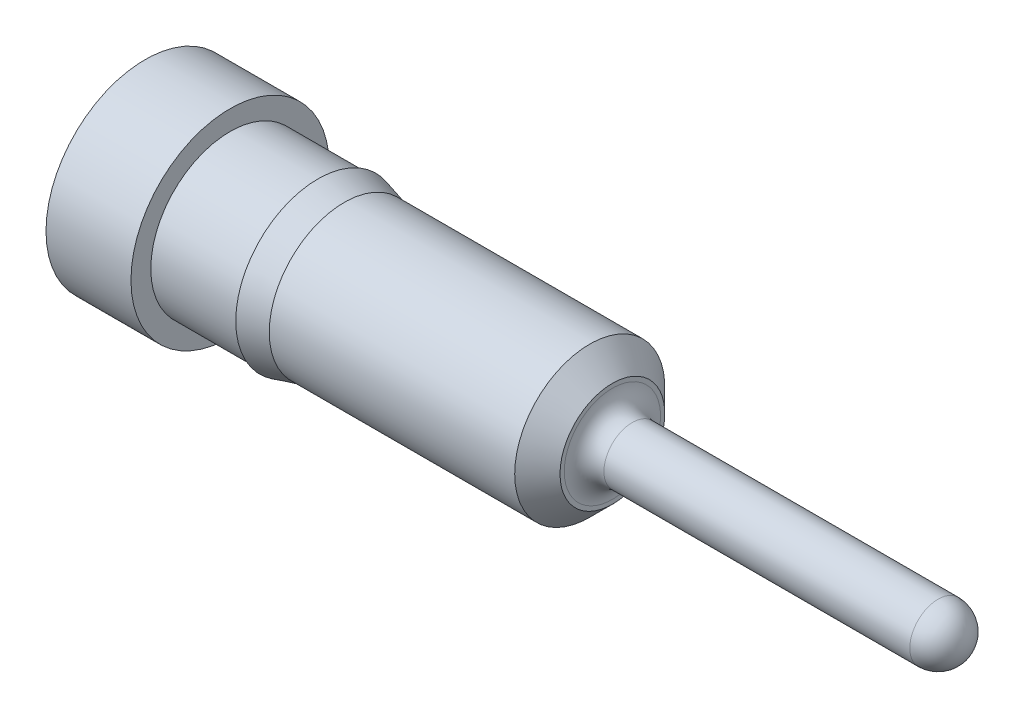
ISO-10303-21;
HEADER;
FILE_DESCRIPTION(('STEP AP214'),'2;1');
FILE_NAME('part.step','',(''),(''),'','','');
FILE_SCHEMA(('AUTOMOTIVE_DESIGN { 1 0 10303 214 1 1 1 1 }'));
ENDSEC;
DATA;
#1=APPLICATION_CONTEXT('core data for automotive mechanical design processes');
#2=APPLICATION_PROTOCOL_DEFINITION('international standard','automotive_design',2000,#1);
#3=PRODUCT_CONTEXT('',#1,'mechanical');
#4=PRODUCT('Part','Part','',(#3));
#5=PRODUCT_RELATED_PRODUCT_CATEGORY('part','',(#4));
#6=PRODUCT_DEFINITION_FORMATION('','',#4);
#7=PRODUCT_DEFINITION_CONTEXT('part definition',#1,'design');
#8=PRODUCT_DEFINITION('design','',#6,#7);
#9=PRODUCT_DEFINITION_SHAPE('','',#8);
#10=(LENGTH_UNIT() NAMED_UNIT(*) SI_UNIT(.MILLI.,.METRE.));
#11=(NAMED_UNIT(*) PLANE_ANGLE_UNIT() SI_UNIT($,.RADIAN.));
#12=(NAMED_UNIT(*) SI_UNIT($,.STERADIAN.) SOLID_ANGLE_UNIT());
#13=UNCERTAINTY_MEASURE_WITH_UNIT(LENGTH_MEASURE(1.E-05),#10,'distance_accuracy_value','');
#14=(GEOMETRIC_REPRESENTATION_CONTEXT(3) GLOBAL_UNCERTAINTY_ASSIGNED_CONTEXT((#13)) GLOBAL_UNIT_ASSIGNED_CONTEXT((#10,
#11,#12)) REPRESENTATION_CONTEXT('',''));
#15=CARTESIAN_POINT('',(0.,0.,0.));
#16=DIRECTION('',(0.,0.,1.));
#17=DIRECTION('',(1.,0.,0.));
#18=AXIS2_PLACEMENT_3D('',#15,#16,#17);
#19=CARTESIAN_POINT('',(4.19099999999997,0.,0.));
#20=DIRECTION('',(-1.,0.,0.));
#21=DIRECTION('',(0.,0.,1.));
#22=AXIS2_PLACEMENT_3D('',#19,#20,#21);
#23=CONICAL_SURFACE('',#22,0.469899999999995,0.785398163397517);
#24=CARTESIAN_POINT('',(3.98780000000001,0.,0.));
#25=DIRECTION('',(-1.,0.,0.));
#26=DIRECTION('',(0.,0.,1.));
#27=AXIS2_PLACEMENT_3D('',#24,#25,#26);
#28=CIRCLE('',#27,0.673099999999982);
#29=CARTESIAN_POINT('',(3.98780000000001,0.,0.673099999999982));
#30=VERTEX_POINT('',#29);
#31=EDGE_CURVE('E10',#30,#30,#28,.T.);
#32=ORIENTED_EDGE('',*,*,#31,.F.);
#33=EDGE_LOOP('',(#32));
#34=FACE_BOUND('',#33,.T.);
#35=CARTESIAN_POINT('',(4.19099999999997,0.,0.));
#36=DIRECTION('',(-1.,0.,0.));
#37=DIRECTION('',(0.,0.,1.));
#38=AXIS2_PLACEMENT_3D('',#35,#36,#37);
#39=CIRCLE('',#38,0.469899999999995);
#40=CARTESIAN_POINT('',(4.19099999999997,0.,0.469899999999995));
#41=VERTEX_POINT('',#40);
#42=EDGE_CURVE('E68',#41,#41,#39,.T.);
#43=ORIENTED_EDGE('',*,*,#42,.T.);
#44=EDGE_LOOP('',(#43));
#45=FACE_BOUND('',#44,.T.);
#46=ADVANCED_FACE('F31',(#34,#45),#23,.T.);
#47=CARTESIAN_POINT('',(0.,0.,0.));
#48=DIRECTION('',(-1.,0.,0.));
#49=DIRECTION('',(0.,0.,1.));
#50=AXIS2_PLACEMENT_3D('',#47,#48,#49);
#51=CYLINDRICAL_SURFACE('',#50,0.673099999999982);
#52=CARTESIAN_POINT('',(1.78638522628082,0.,0.));
#53=DIRECTION('',(-1.,0.,0.));
#54=DIRECTION('',(0.,0.,1.));
#55=AXIS2_PLACEMENT_3D('',#52,#53,#54);
#56=CIRCLE('',#55,0.673099999999982);
#57=CARTESIAN_POINT('',(1.78638522628082,0.,0.673099999999982));
#58=VERTEX_POINT('',#57);
#59=EDGE_CURVE('E37',#58,#58,#56,.T.);
#60=ORIENTED_EDGE('',*,*,#59,.F.);
#61=EDGE_LOOP('',(#60));
#62=FACE_BOUND('',#61,.T.);
#63=ORIENTED_EDGE('',*,*,#31,.T.);
#64=EDGE_LOOP('',(#63));
#65=FACE_BOUND('',#64,.T.);
#66=ADVANCED_FACE('F102',(#62,#65),#51,.T.);
#67=CARTESIAN_POINT('',(1.78638522628082,0.,0.));
#68=DIRECTION('',(-1.,0.,0.));
#69=DIRECTION('',(0.,0.,1.));
#70=AXIS2_PLACEMENT_3D('',#67,#68,#69);
#71=CONICAL_SURFACE('',#70,0.673099999999982,0.261799387799026);
#72=CARTESIAN_POINT('',(1.54939999999999,0.,0.));
#73=DIRECTION('',(-1.,0.,0.));
#74=DIRECTION('',(0.,0.,1.));
#75=AXIS2_PLACEMENT_3D('',#72,#73,#74);
#76=CIRCLE('',#75,0.736600000000004);
#77=CARTESIAN_POINT('',(1.54939999999999,0.,0.736600000000004));
#78=VERTEX_POINT('',#77);
#79=EDGE_CURVE('E41',#78,#78,#76,.T.);
#80=ORIENTED_EDGE('',*,*,#79,.F.);
#81=EDGE_LOOP('',(#80));
#82=FACE_BOUND('',#81,.T.);
#83=ORIENTED_EDGE('',*,*,#59,.T.);
#84=EDGE_LOOP('',(#83));
#85=FACE_BOUND('',#84,.T.);
#86=ADVANCED_FACE('F107',(#82,#85),#71,.T.);
#87=CARTESIAN_POINT('',(1.54939999999999,0.7112,0.));
#88=DIRECTION('',(1.,0.,0.));
#89=DIRECTION('',(0.,0.,-1.));
#90=AXIS2_PLACEMENT_3D('',#87,#88,#89);
#91=PLANE('',#90);
#92=CARTESIAN_POINT('',(1.54939999999999,0.,0.));
#93=DIRECTION('',(-1.,0.,0.));
#94=DIRECTION('',(0.,0.,1.));
#95=AXIS2_PLACEMENT_3D('',#92,#93,#94);
#96=CIRCLE('',#95,0.7112);
#97=CARTESIAN_POINT('',(1.54939999999999,0.,0.7112));
#98=VERTEX_POINT('',#97);
#99=EDGE_CURVE('E45',#98,#98,#96,.T.);
#100=ORIENTED_EDGE('',*,*,#99,.F.);
#101=EDGE_LOOP('',(#100));
#102=FACE_BOUND('',#101,.T.);
#103=ORIENTED_EDGE('',*,*,#79,.T.);
#104=EDGE_LOOP('',(#103));
#105=FACE_BOUND('',#104,.T.);
#106=ADVANCED_FACE('F112',(#102,#105),#91,.F.);
#107=CARTESIAN_POINT('',(0.,0.,0.));
#108=DIRECTION('',(-1.,0.,0.));
#109=DIRECTION('',(0.,0.,1.));
#110=AXIS2_PLACEMENT_3D('',#107,#108,#109);
#111=CYLINDRICAL_SURFACE('',#110,0.7112);
#112=CARTESIAN_POINT('',(0.761999999999971,0.,0.));
#113=DIRECTION('',(-1.,0.,0.));
#114=DIRECTION('',(0.,0.,1.));
#115=AXIS2_PLACEMENT_3D('',#112,#113,#114);
#116=CIRCLE('',#115,0.7112);
#117=CARTESIAN_POINT('',(0.761999999999971,0.,0.7112));
#118=VERTEX_POINT('',#117);
#119=EDGE_CURVE('E50',#118,#118,#116,.T.);
#120=ORIENTED_EDGE('',*,*,#119,.F.);
#121=EDGE_LOOP('',(#120));
#122=FACE_BOUND('',#121,.T.);
#123=ORIENTED_EDGE('',*,*,#99,.T.);
#124=EDGE_LOOP('',(#123));
#125=FACE_BOUND('',#124,.T.);
#126=ADVANCED_FACE('F118',(#122,#125),#111,.T.);
#127=CARTESIAN_POINT('',(0.761999999999985,0.888999999999945,0.));
#128=DIRECTION('',(-1.,0.,0.));
#129=DIRECTION('',(0.,0.,1.));
#130=AXIS2_PLACEMENT_3D('',#127,#128,#129);
#131=PLANE('',#130);
#132=CARTESIAN_POINT('',(0.761999999999999,0.,0.));
#133=DIRECTION('',(-1.,0.,0.));
#134=DIRECTION('',(0.,0.,1.));
#135=AXIS2_PLACEMENT_3D('',#132,#133,#134);
#136=CIRCLE('',#135,0.888999999999945);
#137=CARTESIAN_POINT('',(0.761999999999999,0.,0.888999999999945));
#138=VERTEX_POINT('',#137);
#139=EDGE_CURVE('E53',#138,#138,#136,.T.);
#140=ORIENTED_EDGE('',*,*,#139,.F.);
#141=EDGE_LOOP('',(#140));
#142=FACE_BOUND('',#141,.T.);
#143=ORIENTED_EDGE('',*,*,#119,.T.);
#144=EDGE_LOOP('',(#143));
#145=FACE_BOUND('',#144,.T.);
#146=ADVANCED_FACE('F122',(#142,#145),#131,.F.);
#147=CARTESIAN_POINT('',(0.,0.,0.));
#148=DIRECTION('',(-1.,0.,0.));
#149=DIRECTION('',(0.,0.,1.));
#150=AXIS2_PLACEMENT_3D('',#147,#148,#149);
#151=CYLINDRICAL_SURFACE('',#150,0.888999999999945);
#152=CARTESIAN_POINT('',(0.,0.,0.));
#153=DIRECTION('',(-1.,0.,0.));
#154=DIRECTION('',(0.,0.,1.));
#155=AXIS2_PLACEMENT_3D('',#152,#153,#154);
#156=CIRCLE('',#155,0.888999999999945);
#157=CARTESIAN_POINT('',(0.,0.,0.888999999999945));
#158=VERTEX_POINT('',#157);
#159=EDGE_CURVE('E56',#158,#158,#156,.T.);
#160=ORIENTED_EDGE('',*,*,#159,.F.);
#161=EDGE_LOOP('',(#160));
#162=FACE_BOUND('',#161,.T.);
#163=ORIENTED_EDGE('',*,*,#139,.T.);
#164=EDGE_LOOP('',(#163));
#165=FACE_BOUND('',#164,.T.);
#166=ADVANCED_FACE('F98',(#162,#165),#151,.T.);
#167=CARTESIAN_POINT('',(0.,0.,0.));
#168=DIRECTION('',(1.,0.,0.));
#169=DIRECTION('',(0.,0.,-1.));
#170=AXIS2_PLACEMENT_3D('',#167,#168,#169);
#171=PLANE('',#170);
#172=ORIENTED_EDGE('',*,*,#159,.T.);
#173=EDGE_LOOP('',(#172));
#174=FACE_BOUND('',#173,.T.);
#175=ADVANCED_FACE('F93',(#174),#171,.F.);
#176=CARTESIAN_POINT('',(7.11200000000001,0.,0.));
#177=DIRECTION('',(-1.,0.,0.));
#178=DIRECTION('',(0.,1.,0.));
#179=AXIS2_PLACEMENT_3D('',#176,#177,#178);
#180=SPHERICAL_SURFACE('',#179,0.254000000000004);
#181=CARTESIAN_POINT('',(7.11200000000001,0.,0.));
#182=DIRECTION('',(-1.,0.,0.));
#183=DIRECTION('',(0.,0.,1.));
#184=AXIS2_PLACEMENT_3D('',#181,#182,#183);
#185=CIRCLE('',#184,0.253999999999976);
#186=CARTESIAN_POINT('',(7.11200000000001,0.,0.253999999999976));
#187=VERTEX_POINT('',#186);
#188=EDGE_CURVE('E59',#187,#187,#185,.T.);
#189=ORIENTED_EDGE('',*,*,#188,.F.);
#190=EDGE_LOOP('',(#189));
#191=FACE_BOUND('',#190,.T.);
#192=ADVANCED_FACE('F88',(#191),#180,.T.);
#193=CARTESIAN_POINT('',(0.,0.,0.));
#194=DIRECTION('',(-1.,0.,0.));
#195=DIRECTION('',(0.,0.,1.));
#196=AXIS2_PLACEMENT_3D('',#193,#194,#195);
#197=CYLINDRICAL_SURFACE('',#196,0.25399999999998);
#198=CARTESIAN_POINT('',(4.36879999999996,0.,0.));
#199=DIRECTION('',(-1.,0.,0.));
#200=DIRECTION('',(0.,0.,1.));
#201=AXIS2_PLACEMENT_3D('',#198,#199,#200);
#202=CIRCLE('',#201,0.253999999999983);
#203=CARTESIAN_POINT('',(4.36879999999996,0.,0.253999999999983));
#204=VERTEX_POINT('',#203);
#205=EDGE_CURVE('E62',#204,#204,#202,.T.);
#206=ORIENTED_EDGE('',*,*,#205,.F.);
#207=EDGE_LOOP('',(#206));
#208=FACE_BOUND('',#207,.T.);
#209=ORIENTED_EDGE('',*,*,#188,.T.);
#210=EDGE_LOOP('',(#209));
#211=FACE_BOUND('',#210,.T.);
#212=ADVANCED_FACE('F82',(#208,#211),#197,.T.);
#213=CARTESIAN_POINT('',(4.36879999999996,0.,0.));
#214=DIRECTION('',(-1.,0.,0.));
#215=DIRECTION('',(0.,0.,1.));
#216=AXIS2_PLACEMENT_3D('',#213,#214,#215);
#217=TOROIDAL_SURFACE('',#216,0.431799999999954,0.177799999999971);
#218=CARTESIAN_POINT('',(4.191,0.,0.));
#219=DIRECTION('',(-1.,0.,0.));
#220=DIRECTION('',(0.,0.,1.));
#221=AXIS2_PLACEMENT_3D('',#218,#219,#220);
#222=CIRCLE('',#221,0.431799999999954);
#223=CARTESIAN_POINT('',(4.191,0.,0.431799999999954));
#224=VERTEX_POINT('',#223);
#225=EDGE_CURVE('E65',#224,#224,#222,.T.);
#226=ORIENTED_EDGE('',*,*,#225,.F.);
#227=EDGE_LOOP('',(#226));
#228=FACE_BOUND('',#227,.T.);
#229=ORIENTED_EDGE('',*,*,#205,.T.);
#230=EDGE_LOOP('',(#229));
#231=FACE_BOUND('',#230,.T.);
#232=ADVANCED_FACE('F76',(#228,#231),#217,.F.);
#233=CARTESIAN_POINT('',(4.19099999999999,0.469899999999995,0.));
#234=DIRECTION('',(-1.,0.,0.));
#235=DIRECTION('',(0.,0.,1.));
#236=AXIS2_PLACEMENT_3D('',#233,#234,#235);
#237=PLANE('',#236);
#238=ORIENTED_EDGE('',*,*,#42,.F.);
#239=EDGE_LOOP('',(#238));
#240=FACE_BOUND('',#239,.T.);
#241=ORIENTED_EDGE('',*,*,#225,.T.);
#242=EDGE_LOOP('',(#241));
#243=FACE_BOUND('',#242,.T.);
#244=ADVANCED_FACE('F73',(#240,#243),#237,.F.);
#245=CLOSED_SHELL('',(#46,#66,#86,#106,#126,#146,#166,#175,#192,#212,#232,#244));
#246=MANIFOLD_SOLID_BREP('B2',#245);
#247=ADVANCED_BREP_SHAPE_REPRESENTATION('',(#18,#246),#14);
#248=SHAPE_DEFINITION_REPRESENTATION(#9,#247);
ENDSEC;
END-ISO-10303-21;
